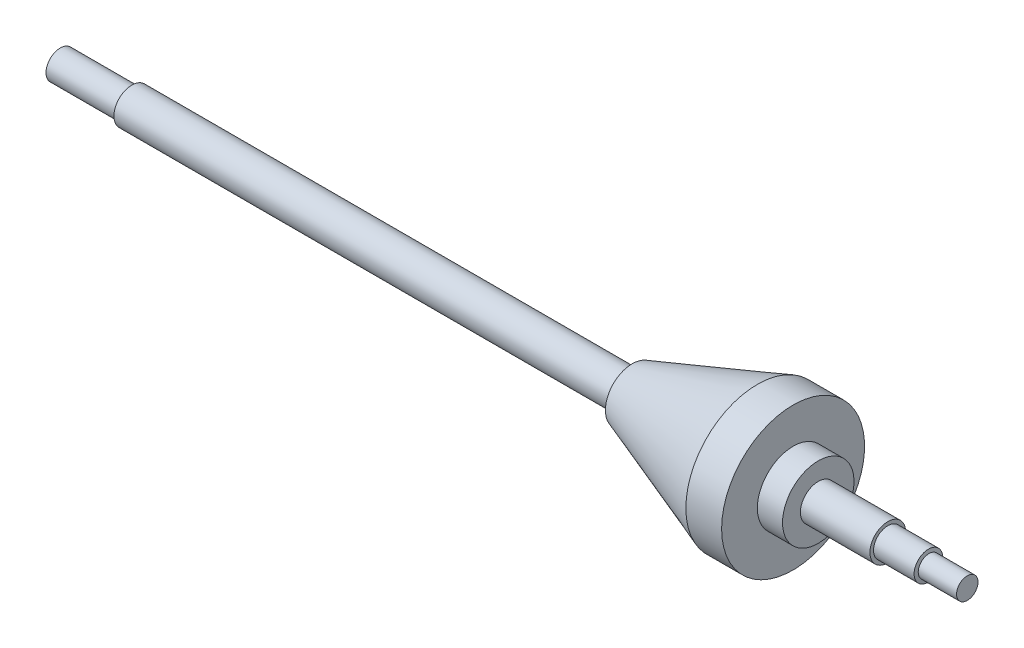
ISO-10303-21;
HEADER;
FILE_DESCRIPTION(('STEP AP214'),'2;1');
FILE_NAME('part.step','',(''),(''),'','','');
FILE_SCHEMA(('AUTOMOTIVE_DESIGN { 1 0 10303 214 1 1 1 1 }'));
ENDSEC;
DATA;
#1=APPLICATION_CONTEXT('core data for automotive mechanical design processes');
#2=APPLICATION_PROTOCOL_DEFINITION('international standard','automotive_design',2000,#1);
#3=PRODUCT_CONTEXT('',#1,'mechanical');
#4=PRODUCT('Part','Part','',(#3));
#5=PRODUCT_RELATED_PRODUCT_CATEGORY('part','',(#4));
#6=PRODUCT_DEFINITION_FORMATION('','',#4);
#7=PRODUCT_DEFINITION_CONTEXT('part definition',#1,'design');
#8=PRODUCT_DEFINITION('design','',#6,#7);
#9=PRODUCT_DEFINITION_SHAPE('','',#8);
#10=(LENGTH_UNIT() NAMED_UNIT(*) SI_UNIT(.MILLI.,.METRE.));
#11=(NAMED_UNIT(*) PLANE_ANGLE_UNIT() SI_UNIT($,.RADIAN.));
#12=(NAMED_UNIT(*) SI_UNIT($,.STERADIAN.) SOLID_ANGLE_UNIT());
#13=UNCERTAINTY_MEASURE_WITH_UNIT(LENGTH_MEASURE(1.E-05),#10,'distance_accuracy_value','');
#14=(GEOMETRIC_REPRESENTATION_CONTEXT(3) GLOBAL_UNCERTAINTY_ASSIGNED_CONTEXT((#13)) GLOBAL_UNIT_ASSIGNED_CONTEXT((#10,
#11,#12)) REPRESENTATION_CONTEXT('',''));
#15=CARTESIAN_POINT('',(0.,0.,0.));
#16=DIRECTION('',(0.,0.,1.));
#17=DIRECTION('',(1.,0.,0.));
#18=AXIS2_PLACEMENT_3D('',#15,#16,#17);
#19=CARTESIAN_POINT('',(0.,0.,0.));
#20=DIRECTION('',(-1.,0.,0.));
#21=DIRECTION('',(0.,0.,1.));
#22=AXIS2_PLACEMENT_3D('',#19,#20,#21);
#23=PLANE('',#22);
#24=CARTESIAN_POINT('',(0.,0.,0.));
#25=DIRECTION('',(-1.,0.,0.));
#26=DIRECTION('',(0.,0.,1.));
#27=AXIS2_PLACEMENT_3D('',#24,#25,#26);
#28=CIRCLE('',#27,4.);
#29=CARTESIAN_POINT('',(0.,0.,4.));
#30=VERTEX_POINT('',#29);
#31=EDGE_CURVE('E10',#30,#30,#28,.T.);
#32=ORIENTED_EDGE('',*,*,#31,.T.);
#33=EDGE_LOOP('',(#32));
#34=FACE_BOUND('',#33,.T.);
#35=ADVANCED_FACE('F31',(#34),#23,.T.);
#36=CARTESIAN_POINT('',(0.,0.,0.));
#37=DIRECTION('',(-1.,0.,0.));
#38=DIRECTION('',(0.,0.,1.));
#39=AXIS2_PLACEMENT_3D('',#36,#37,#38);
#40=CYLINDRICAL_SURFACE('',#39,4.);
#41=CARTESIAN_POINT('',(20.,0.,0.));
#42=DIRECTION('',(-1.,0.,0.));
#43=DIRECTION('',(0.,0.,1.));
#44=AXIS2_PLACEMENT_3D('',#41,#42,#43);
#45=CIRCLE('',#44,4.);
#46=CARTESIAN_POINT('',(20.,0.,4.));
#47=VERTEX_POINT('',#46);
#48=EDGE_CURVE('E37',#47,#47,#45,.T.);
#49=ORIENTED_EDGE('',*,*,#48,.T.);
#50=EDGE_LOOP('',(#49));
#51=FACE_BOUND('',#50,.T.);
#52=ORIENTED_EDGE('',*,*,#31,.F.);
#53=EDGE_LOOP('',(#52));
#54=FACE_BOUND('',#53,.T.);
#55=ADVANCED_FACE('F96',(#51,#54),#40,.T.);
#56=CARTESIAN_POINT('',(20.,0.,4.));
#57=DIRECTION('',(-1.,0.,0.));
#58=DIRECTION('',(0.,0.,1.));
#59=AXIS2_PLACEMENT_3D('',#56,#57,#58);
#60=PLANE('',#59);
#61=CARTESIAN_POINT('',(20.,0.,0.));
#62=DIRECTION('',(-1.,0.,0.));
#63=DIRECTION('',(0.,0.,1.));
#64=AXIS2_PLACEMENT_3D('',#61,#62,#63);
#65=CIRCLE('',#64,5.);
#66=CARTESIAN_POINT('',(20.,0.,5.));
#67=VERTEX_POINT('',#66);
#68=EDGE_CURVE('E41',#67,#67,#65,.T.);
#69=ORIENTED_EDGE('',*,*,#68,.T.);
#70=EDGE_LOOP('',(#69));
#71=FACE_BOUND('',#70,.T.);
#72=ORIENTED_EDGE('',*,*,#48,.F.);
#73=EDGE_LOOP('',(#72));
#74=FACE_BOUND('',#73,.T.);
#75=ADVANCED_FACE('F100',(#71,#74),#60,.T.);
#76=CARTESIAN_POINT('',(0.,0.,0.));
#77=DIRECTION('',(-1.,0.,0.));
#78=DIRECTION('',(0.,0.,1.));
#79=AXIS2_PLACEMENT_3D('',#76,#77,#78);
#80=CYLINDRICAL_SURFACE('',#79,5.);
#81=CARTESIAN_POINT('',(160.,0.,0.));
#82=DIRECTION('',(-1.,0.,0.));
#83=DIRECTION('',(0.,0.,1.));
#84=AXIS2_PLACEMENT_3D('',#81,#82,#83);
#85=CIRCLE('',#84,5.);
#86=CARTESIAN_POINT('',(160.,0.,5.));
#87=VERTEX_POINT('',#86);
#88=EDGE_CURVE('E45',#87,#87,#85,.T.);
#89=ORIENTED_EDGE('',*,*,#88,.T.);
#90=EDGE_LOOP('',(#89));
#91=FACE_BOUND('',#90,.T.);
#92=ORIENTED_EDGE('',*,*,#68,.F.);
#93=EDGE_LOOP('',(#92));
#94=FACE_BOUND('',#93,.T.);
#95=ADVANCED_FACE('F104',(#91,#94),#80,.T.);
#96=CARTESIAN_POINT('',(160.,0.,5.));
#97=DIRECTION('',(-1.,0.,0.));
#98=DIRECTION('',(0.,0.,1.));
#99=AXIS2_PLACEMENT_3D('',#96,#97,#98);
#100=PLANE('',#99);
#101=CARTESIAN_POINT('',(160.,0.,0.));
#102=DIRECTION('',(-1.,0.,0.));
#103=DIRECTION('',(0.,0.,1.));
#104=AXIS2_PLACEMENT_3D('',#101,#102,#103);
#105=CIRCLE('',#104,7.5);
#106=CARTESIAN_POINT('',(160.,0.,7.5));
#107=VERTEX_POINT('',#106);
#108=EDGE_CURVE('E50',#107,#107,#105,.T.);
#109=ORIENTED_EDGE('',*,*,#108,.T.);
#110=EDGE_LOOP('',(#109));
#111=FACE_BOUND('',#110,.T.);
#112=ORIENTED_EDGE('',*,*,#88,.F.);
#113=EDGE_LOOP('',(#112));
#114=FACE_BOUND('',#113,.T.);
#115=ADVANCED_FACE('F111',(#111,#114),#100,.T.);
#116=CARTESIAN_POINT('',(160.,0.,0.));
#117=DIRECTION('',(1.,0.,0.));
#118=DIRECTION('',(0.,0.,-1.));
#119=AXIS2_PLACEMENT_3D('',#116,#117,#118);
#120=CONICAL_SURFACE('',#119,7.5,0.343023940420703);
#121=CARTESIAN_POINT('',(195.,0.,0.));
#122=DIRECTION('',(-1.,0.,0.));
#123=DIRECTION('',(0.,0.,1.));
#124=AXIS2_PLACEMENT_3D('',#121,#122,#123);
#125=CIRCLE('',#124,20.);
#126=CARTESIAN_POINT('',(195.,0.,20.));
#127=VERTEX_POINT('',#126);
#128=EDGE_CURVE('E53',#127,#127,#125,.T.);
#129=ORIENTED_EDGE('',*,*,#128,.T.);
#130=EDGE_LOOP('',(#129));
#131=FACE_BOUND('',#130,.T.);
#132=ORIENTED_EDGE('',*,*,#108,.F.);
#133=EDGE_LOOP('',(#132));
#134=FACE_BOUND('',#133,.T.);
#135=ADVANCED_FACE('F115',(#131,#134),#120,.T.);
#136=CARTESIAN_POINT('',(0.,0.,0.));
#137=DIRECTION('',(-1.,0.,0.));
#138=DIRECTION('',(0.,0.,1.));
#139=AXIS2_PLACEMENT_3D('',#136,#137,#138);
#140=CYLINDRICAL_SURFACE('',#139,20.);
#141=CARTESIAN_POINT('',(205.,0.,0.));
#142=DIRECTION('',(-1.,0.,0.));
#143=DIRECTION('',(0.,0.,1.));
#144=AXIS2_PLACEMENT_3D('',#141,#142,#143);
#145=CIRCLE('',#144,20.);
#146=CARTESIAN_POINT('',(205.,0.,20.));
#147=VERTEX_POINT('',#146);
#148=EDGE_CURVE('E56',#147,#147,#145,.T.);
#149=ORIENTED_EDGE('',*,*,#148,.T.);
#150=EDGE_LOOP('',(#149));
#151=FACE_BOUND('',#150,.T.);
#152=ORIENTED_EDGE('',*,*,#128,.F.);
#153=EDGE_LOOP('',(#152));
#154=FACE_BOUND('',#153,.T.);
#155=ADVANCED_FACE('F119',(#151,#154),#140,.T.);
#156=CARTESIAN_POINT('',(205.,0.,20.));
#157=DIRECTION('',(1.,0.,0.));
#158=DIRECTION('',(0.,0.,-1.));
#159=AXIS2_PLACEMENT_3D('',#156,#157,#158);
#160=PLANE('',#159);
#161=CARTESIAN_POINT('',(205.,0.,0.));
#162=DIRECTION('',(-1.,0.,0.));
#163=DIRECTION('',(0.,0.,1.));
#164=AXIS2_PLACEMENT_3D('',#161,#162,#163);
#165=CIRCLE('',#164,10.);
#166=CARTESIAN_POINT('',(205.,0.,10.));
#167=VERTEX_POINT('',#166);
#168=EDGE_CURVE('E59',#167,#167,#165,.T.);
#169=ORIENTED_EDGE('',*,*,#168,.T.);
#170=EDGE_LOOP('',(#169));
#171=FACE_BOUND('',#170,.T.);
#172=ORIENTED_EDGE('',*,*,#148,.F.);
#173=EDGE_LOOP('',(#172));
#174=FACE_BOUND('',#173,.T.);
#175=ADVANCED_FACE('F123',(#171,#174),#160,.T.);
#176=CARTESIAN_POINT('',(0.,0.,0.));
#177=DIRECTION('',(-1.,0.,0.));
#178=DIRECTION('',(0.,0.,1.));
#179=AXIS2_PLACEMENT_3D('',#176,#177,#178);
#180=CYLINDRICAL_SURFACE('',#179,10.);
#181=CARTESIAN_POINT('',(212.040983141803,0.,0.));
#182=DIRECTION('',(-1.,0.,0.));
#183=DIRECTION('',(0.,0.,1.));
#184=AXIS2_PLACEMENT_3D('',#181,#182,#183);
#185=CIRCLE('',#184,10.);
#186=CARTESIAN_POINT('',(212.040983141803,0.,10.));
#187=VERTEX_POINT('',#186);
#188=EDGE_CURVE('E62',#187,#187,#185,.T.);
#189=ORIENTED_EDGE('',*,*,#188,.T.);
#190=EDGE_LOOP('',(#189));
#191=FACE_BOUND('',#190,.T.);
#192=ORIENTED_EDGE('',*,*,#168,.F.);
#193=EDGE_LOOP('',(#192));
#194=FACE_BOUND('',#193,.T.);
#195=ADVANCED_FACE('F127',(#191,#194),#180,.T.);
#196=CARTESIAN_POINT('',(212.040983141803,0.,10.));
#197=DIRECTION('',(1.,0.,0.));
#198=DIRECTION('',(0.,0.,-1.));
#199=AXIS2_PLACEMENT_3D('',#196,#197,#198);
#200=PLANE('',#199);
#201=CARTESIAN_POINT('',(212.040983141803,0.,0.));
#202=DIRECTION('',(-1.,0.,0.));
#203=DIRECTION('',(0.,0.,1.));
#204=AXIS2_PLACEMENT_3D('',#201,#202,#203);
#205=CIRCLE('',#204,5.);
#206=CARTESIAN_POINT('',(212.040983141803,0.,5.));
#207=VERTEX_POINT('',#206);
#208=EDGE_CURVE('E65',#207,#207,#205,.T.);
#209=ORIENTED_EDGE('',*,*,#208,.T.);
#210=EDGE_LOOP('',(#209));
#211=FACE_BOUND('',#210,.T.);
#212=ORIENTED_EDGE('',*,*,#188,.F.);
#213=EDGE_LOOP('',(#212));
#214=FACE_BOUND('',#213,.T.);
#215=ADVANCED_FACE('F131',(#211,#214),#200,.T.);
#216=CARTESIAN_POINT('',(0.,0.,0.));
#217=DIRECTION('',(-1.,0.,0.));
#218=DIRECTION('',(0.,0.,1.));
#219=AXIS2_PLACEMENT_3D('',#216,#217,#218);
#220=CYLINDRICAL_SURFACE('',#219,5.);
#221=CARTESIAN_POINT('',(231.496163682864,0.,0.));
#222=DIRECTION('',(-1.,0.,0.));
#223=DIRECTION('',(0.,0.,1.));
#224=AXIS2_PLACEMENT_3D('',#221,#222,#223);
#225=CIRCLE('',#224,5.);
#226=CARTESIAN_POINT('',(231.496163682864,0.,5.));
#227=VERTEX_POINT('',#226);
#228=EDGE_CURVE('E68',#227,#227,#225,.T.);
#229=ORIENTED_EDGE('',*,*,#228,.T.);
#230=EDGE_LOOP('',(#229));
#231=FACE_BOUND('',#230,.T.);
#232=ORIENTED_EDGE('',*,*,#208,.F.);
#233=EDGE_LOOP('',(#232));
#234=FACE_BOUND('',#233,.T.);
#235=ADVANCED_FACE('F135',(#231,#234),#220,.T.);
#236=CARTESIAN_POINT('',(231.496163682864,0.,5.));
#237=DIRECTION('',(1.,0.,0.));
#238=DIRECTION('',(0.,0.,-1.));
#239=AXIS2_PLACEMENT_3D('',#236,#237,#238);
#240=PLANE('',#239);
#241=CARTESIAN_POINT('',(231.496163682864,0.,0.));
#242=DIRECTION('',(-1.,0.,0.));
#243=DIRECTION('',(0.,0.,1.));
#244=AXIS2_PLACEMENT_3D('',#241,#242,#243);
#245=CIRCLE('',#244,4.);
#246=CARTESIAN_POINT('',(231.496163682864,0.,4.));
#247=VERTEX_POINT('',#246);
#248=EDGE_CURVE('E71',#247,#247,#245,.T.);
#249=ORIENTED_EDGE('',*,*,#248,.T.);
#250=EDGE_LOOP('',(#249));
#251=FACE_BOUND('',#250,.T.);
#252=ORIENTED_EDGE('',*,*,#228,.F.);
#253=EDGE_LOOP('',(#252));
#254=FACE_BOUND('',#253,.T.);
#255=ADVANCED_FACE('F139',(#251,#254),#240,.T.);
#256=CARTESIAN_POINT('',(0.,0.,0.));
#257=DIRECTION('',(-1.,0.,0.));
#258=DIRECTION('',(0.,0.,1.));
#259=AXIS2_PLACEMENT_3D('',#256,#257,#258);
#260=CYLINDRICAL_SURFACE('',#259,4.);
#261=CARTESIAN_POINT('',(242.851662404092,0.,0.));
#262=DIRECTION('',(-1.,0.,0.));
#263=DIRECTION('',(0.,0.,1.));
#264=AXIS2_PLACEMENT_3D('',#261,#262,#263);
#265=CIRCLE('',#264,4.);
#266=CARTESIAN_POINT('',(242.851662404092,0.,4.));
#267=VERTEX_POINT('',#266);
#268=EDGE_CURVE('E74',#267,#267,#265,.T.);
#269=ORIENTED_EDGE('',*,*,#268,.T.);
#270=EDGE_LOOP('',(#269));
#271=FACE_BOUND('',#270,.T.);
#272=ORIENTED_EDGE('',*,*,#248,.F.);
#273=EDGE_LOOP('',(#272));
#274=FACE_BOUND('',#273,.T.);
#275=ADVANCED_FACE('F143',(#271,#274),#260,.T.);
#276=CARTESIAN_POINT('',(242.851662404092,0.,0.));
#277=DIRECTION('',(-1.,0.,0.));
#278=DIRECTION('',(0.,0.,1.));
#279=AXIS2_PLACEMENT_3D('',#276,#277,#278);
#280=CONICAL_SURFACE('',#279,4.,1.41749842678393);
#281=CARTESIAN_POINT('',(243.006172546707,0.,0.));
#282=DIRECTION('',(-1.,0.,0.));
#283=DIRECTION('',(0.,0.,1.));
#284=AXIS2_PLACEMENT_3D('',#281,#282,#283);
#285=CIRCLE('',#284,3.);
#286=CARTESIAN_POINT('',(243.006172546707,0.,3.));
#287=VERTEX_POINT('',#286);
#288=EDGE_CURVE('E77',#287,#287,#285,.T.);
#289=ORIENTED_EDGE('',*,*,#288,.T.);
#290=EDGE_LOOP('',(#289));
#291=FACE_BOUND('',#290,.T.);
#292=ORIENTED_EDGE('',*,*,#268,.F.);
#293=EDGE_LOOP('',(#292));
#294=FACE_BOUND('',#293,.T.);
#295=ADVANCED_FACE('F93',(#291,#294),#280,.T.);
#296=CARTESIAN_POINT('',(0.,0.,0.));
#297=DIRECTION('',(-1.,0.,0.));
#298=DIRECTION('',(0.,0.,1.));
#299=AXIS2_PLACEMENT_3D('',#296,#297,#298);
#300=CYLINDRICAL_SURFACE('',#299,3.);
#301=CARTESIAN_POINT('',(253.734015345269,0.,0.));
#302=DIRECTION('',(-1.,0.,0.));
#303=DIRECTION('',(0.,0.,1.));
#304=AXIS2_PLACEMENT_3D('',#301,#302,#303);
#305=CIRCLE('',#304,3.);
#306=CARTESIAN_POINT('',(253.734015345269,0.,3.));
#307=VERTEX_POINT('',#306);
#308=EDGE_CURVE('E80',#307,#307,#305,.T.);
#309=ORIENTED_EDGE('',*,*,#308,.T.);
#310=EDGE_LOOP('',(#309));
#311=FACE_BOUND('',#310,.T.);
#312=ORIENTED_EDGE('',*,*,#288,.F.);
#313=EDGE_LOOP('',(#312));
#314=FACE_BOUND('',#313,.T.);
#315=ADVANCED_FACE('F84',(#311,#314),#300,.T.);
#316=CARTESIAN_POINT('',(253.734015345269,0.,3.));
#317=DIRECTION('',(1.,0.,0.));
#318=DIRECTION('',(0.,0.,-1.));
#319=AXIS2_PLACEMENT_3D('',#316,#317,#318);
#320=PLANE('',#319);
#321=ORIENTED_EDGE('',*,*,#308,.F.);
#322=EDGE_LOOP('',(#321));
#323=FACE_BOUND('',#322,.T.);
#324=ADVANCED_FACE('F87',(#323),#320,.T.);
#325=CLOSED_SHELL('',(#35,#55,#75,#95,#115,#135,#155,#175,#195,#215,#235,#255,#275,#295,#315,#324));
#326=MANIFOLD_SOLID_BREP('B2',#325);
#327=ADVANCED_BREP_SHAPE_REPRESENTATION('',(#18,#326),#14);
#328=SHAPE_DEFINITION_REPRESENTATION(#9,#327);
ENDSEC;
END-ISO-10303-21;
